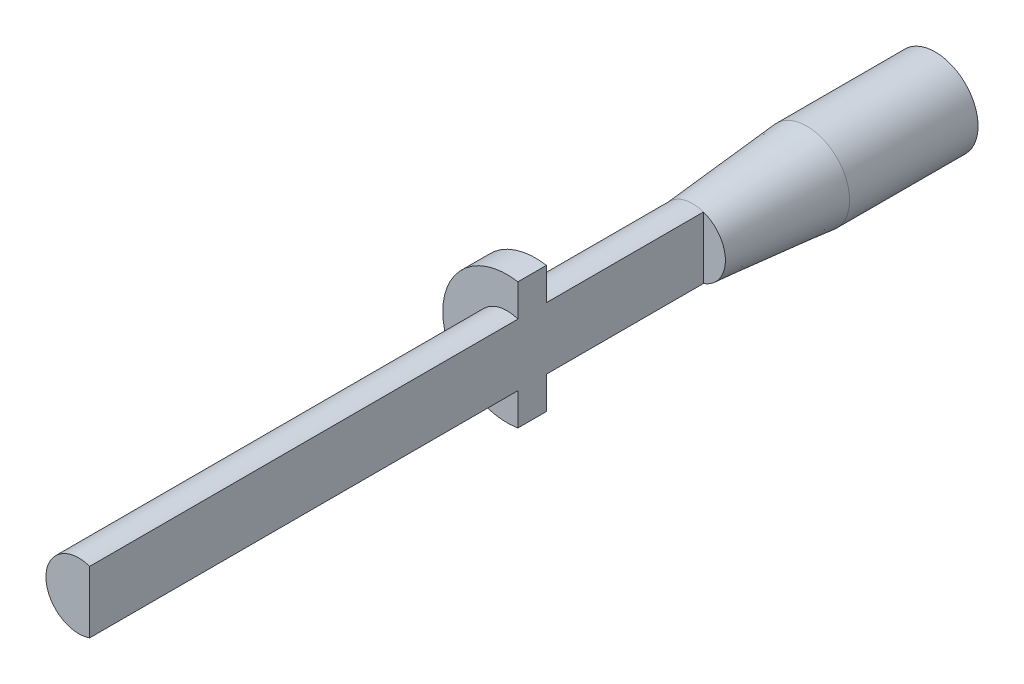
ISO-10303-21;
HEADER;
FILE_DESCRIPTION(('STEP AP214'),'2;1');
FILE_NAME('part.step','',(''),(''),'','','');
FILE_SCHEMA(('AUTOMOTIVE_DESIGN { 1 0 10303 214 1 1 1 1 }'));
ENDSEC;
DATA;
#1=APPLICATION_CONTEXT('core data for automotive mechanical design processes');
#2=APPLICATION_PROTOCOL_DEFINITION('international standard','automotive_design',2000,#1);
#3=PRODUCT_CONTEXT('',#1,'mechanical');
#4=PRODUCT('Part','Part','',(#3));
#5=PRODUCT_RELATED_PRODUCT_CATEGORY('part','',(#4));
#6=PRODUCT_DEFINITION_FORMATION('','',#4);
#7=PRODUCT_DEFINITION_CONTEXT('part definition',#1,'design');
#8=PRODUCT_DEFINITION('design','',#6,#7);
#9=PRODUCT_DEFINITION_SHAPE('','',#8);
#10=(LENGTH_UNIT() NAMED_UNIT(*) SI_UNIT(.MILLI.,.METRE.));
#11=(NAMED_UNIT(*) PLANE_ANGLE_UNIT() SI_UNIT($,.RADIAN.));
#12=(NAMED_UNIT(*) SI_UNIT($,.STERADIAN.) SOLID_ANGLE_UNIT());
#13=UNCERTAINTY_MEASURE_WITH_UNIT(LENGTH_MEASURE(1.E-05),#10,'distance_accuracy_value','');
#14=(GEOMETRIC_REPRESENTATION_CONTEXT(3) GLOBAL_UNCERTAINTY_ASSIGNED_CONTEXT((#13)) GLOBAL_UNIT_ASSIGNED_CONTEXT((#10,
#11,#12)) REPRESENTATION_CONTEXT('',''));
#15=CARTESIAN_POINT('',(0.,0.,0.));
#16=DIRECTION('',(0.,0.,1.));
#17=DIRECTION('',(1.,0.,0.));
#18=AXIS2_PLACEMENT_3D('',#15,#16,#17);
#19=CARTESIAN_POINT('',(0.,0.,-13.));
#20=DIRECTION('',(0.,0.,-1.));
#21=DIRECTION('',(-1.,0.,0.));
#22=AXIS2_PLACEMENT_3D('',#19,#20,#21);
#23=CYLINDRICAL_SURFACE('',#22,3.);
#24=CARTESIAN_POINT('',(0.,0.,-30.));
#25=DIRECTION('',(0.,0.,-1.));
#26=DIRECTION('',(-1.,0.,0.));
#27=AXIS2_PLACEMENT_3D('',#24,#25,#26);
#28=CIRCLE('',#27,3.);
#29=CARTESIAN_POINT('',(-3.,0.,-30.));
#30=VERTEX_POINT('',#29);
#31=EDGE_CURVE('E110',#30,#30,#28,.T.);
#32=ORIENTED_EDGE('',*,*,#31,.F.);
#33=EDGE_LOOP('',(#32));
#34=FACE_BOUND('',#33,.T.);
#35=CARTESIAN_POINT('',(0.,0.,-21.));
#36=DIRECTION('',(0.,0.,1.));
#37=DIRECTION('',(1.,0.,0.));
#38=AXIS2_PLACEMENT_3D('',#35,#36,#37);
#39=CIRCLE('',#38,3.);
#40=CARTESIAN_POINT('',(3.,0.,-21.));
#41=VERTEX_POINT('',#40);
#42=EDGE_CURVE('E168',#41,#41,#39,.T.);
#43=ORIENTED_EDGE('',*,*,#42,.F.);
#44=EDGE_LOOP('',(#43));
#45=FACE_BOUND('',#44,.T.);
#46=ADVANCED_FACE('F33',(#34,#45),#23,.T.);
#47=CARTESIAN_POINT('',(0.,0.,-30.));
#48=DIRECTION('',(0.,0.,1.));
#49=DIRECTION('',(1.,0.,0.));
#50=AXIS2_PLACEMENT_3D('',#47,#48,#49);
#51=PLANE('',#50);
#52=DIRECTION('',(0.,-1.,0.));
#53=VECTOR('',#52,1.);
#54=CARTESIAN_POINT('',(1.59,1.40979608454556,-30.));
#55=LINE('',#54,#53);
#56=CARTESIAN_POINT('',(1.59,1.40979608454556,-30.));
#57=VERTEX_POINT('',#56);
#58=CARTESIAN_POINT('',(1.59,-1.40979608454556,-30.));
#59=VERTEX_POINT('',#58);
#60=EDGE_CURVE('E163',#57,#59,#55,.T.);
#61=ORIENTED_EDGE('',*,*,#60,.F.);
#62=CARTESIAN_POINT('',(0.,0.,-30.));
#63=DIRECTION('',(0.,0.,-1.));
#64=DIRECTION('',(-1.,0.,0.));
#65=AXIS2_PLACEMENT_3D('',#62,#63,#64);
#66=CIRCLE('',#65,2.125);
#67=EDGE_CURVE('E48',#59,#57,#66,.T.);
#68=ORIENTED_EDGE('',*,*,#67,.F.);
#69=EDGE_LOOP('',(#61,#68));
#70=FACE_BOUND('',#69,.T.);
#71=ORIENTED_EDGE('',*,*,#31,.T.);
#72=EDGE_LOOP('',(#71));
#73=FACE_BOUND('',#72,.T.);
#74=ADVANCED_FACE('F178',(#70,#73),#51,.F.);
#75=CARTESIAN_POINT('',(0.,0.,-22.5));
#76=DIRECTION('',(0.,0.,-1.));
#77=DIRECTION('',(-1.,0.,0.));
#78=AXIS2_PLACEMENT_3D('',#75,#76,#77);
#79=CYLINDRICAL_SURFACE('',#78,2.125);
#80=ORIENTED_EDGE('',*,*,#67,.T.);
#81=DIRECTION('',(0.,0.,-1.));
#82=VECTOR('',#81,1.);
#83=CARTESIAN_POINT('',(1.59,1.40979608454556,-22.5));
#84=LINE('',#83,#82);
#85=CARTESIAN_POINT('',(1.59,1.40979608454556,-22.5));
#86=VERTEX_POINT('',#85);
#87=EDGE_CURVE('E159',#86,#57,#84,.T.);
#88=ORIENTED_EDGE('',*,*,#87,.F.);
#89=CARTESIAN_POINT('',(0.,0.,-22.5));
#90=DIRECTION('',(0.,0.,-1.));
#91=DIRECTION('',(-1.,0.,0.));
#92=AXIS2_PLACEMENT_3D('',#89,#90,#91);
#93=CIRCLE('',#92,2.125);
#94=CARTESIAN_POINT('',(1.59,-1.40979608454556,-22.5));
#95=VERTEX_POINT('',#94);
#96=EDGE_CURVE('E166',#95,#86,#93,.T.);
#97=ORIENTED_EDGE('',*,*,#96,.F.);
#98=DIRECTION('',(0.,0.,-1.));
#99=VECTOR('',#98,1.);
#100=CARTESIAN_POINT('',(1.59,-1.40979608454556,-22.5));
#101=LINE('',#100,#99);
#102=EDGE_CURVE('E158',#95,#59,#101,.T.);
#103=ORIENTED_EDGE('',*,*,#102,.T.);
#104=EDGE_LOOP('',(#80,#88,#97,#103));
#105=FACE_BOUND('',#104,.T.);
#106=ADVANCED_FACE('F184',(#105),#79,.F.);
#107=CARTESIAN_POINT('',(1.59,1.40979608454556,-22.5));
#108=DIRECTION('',(1.,0.,0.));
#109=DIRECTION('',(0.,0.,-1.));
#110=AXIS2_PLACEMENT_3D('',#107,#108,#109);
#111=PLANE('',#110);
#112=ORIENTED_EDGE('',*,*,#60,.T.);
#113=ORIENTED_EDGE('',*,*,#102,.F.);
#114=DIRECTION('',(0.,-1.,0.));
#115=VECTOR('',#114,1.);
#116=CARTESIAN_POINT('',(1.59,1.40979608454556,-22.5));
#117=LINE('',#116,#115);
#118=EDGE_CURVE('E161',#86,#95,#117,.T.);
#119=ORIENTED_EDGE('',*,*,#118,.F.);
#120=ORIENTED_EDGE('',*,*,#87,.T.);
#121=EDGE_LOOP('',(#112,#113,#119,#120));
#122=FACE_BOUND('',#121,.T.);
#123=ADVANCED_FACE('F245',(#122),#111,.F.);
#124=CARTESIAN_POINT('',(0.,0.,-22.5));
#125=DIRECTION('',(0.,0.,-1.));
#126=DIRECTION('',(-1.,0.,0.));
#127=AXIS2_PLACEMENT_3D('',#124,#125,#126);
#128=PLANE('',#127);
#129=ORIENTED_EDGE('',*,*,#96,.T.);
#130=ORIENTED_EDGE('',*,*,#118,.T.);
#131=EDGE_LOOP('',(#129,#130));
#132=FACE_BOUND('',#131,.T.);
#133=ADVANCED_FACE('F238',(#132),#128,.T.);
#134=CARTESIAN_POINT('',(0.,0.,-13.));
#135=DIRECTION('',(0.,0.,-1.));
#136=DIRECTION('',(-1.,0.,0.));
#137=AXIS2_PLACEMENT_3D('',#134,#135,#136);
#138=CONICAL_SURFACE('',#137,2.3,0.0872777129494616);
#139=ORIENTED_EDGE('',*,*,#42,.T.);
#140=EDGE_LOOP('',(#139));
#141=FACE_BOUND('',#140,.T.);
#142=CARTESIAN_POINT('',(0.,0.,-13.));
#143=DIRECTION('',(0.,0.,-1.));
#144=DIRECTION('',(-1.,0.,0.));
#145=AXIS2_PLACEMENT_3D('',#142,#143,#144);
#146=CIRCLE('',#145,2.3);
#147=CARTESIAN_POINT('',(0.762299153875957,2.17,-13.));
#148=VERTEX_POINT('',#147);
#149=CARTESIAN_POINT('',(0.762299153875957,-2.17,-13.));
#150=VERTEX_POINT('',#149);
#151=EDGE_CURVE('E41',#148,#150,#146,.F.);
#152=ORIENTED_EDGE('',*,*,#151,.F.);
#153=CARTESIAN_POINT('',(0.,0.,-13.));
#154=DIRECTION('',(0.,0.,-1.));
#155=DIRECTION('',(-1.,0.,0.));
#156=AXIS2_PLACEMENT_3D('',#153,#154,#155);
#157=CIRCLE('',#156,2.3);
#158=EDGE_CURVE('E11',#148,#150,#157,.T.);
#159=ORIENTED_EDGE('',*,*,#158,.T.);
#160=EDGE_LOOP('',(#152,#159));
#161=FACE_BOUND('',#160,.T.);
#162=ADVANCED_FACE('F94',(#141,#161),#138,.T.);
#163=CARTESIAN_POINT('',(0.,0.,30.));
#164=DIRECTION('',(0.,0.,1.));
#165=DIRECTION('',(1.,0.,0.));
#166=AXIS2_PLACEMENT_3D('',#163,#164,#165);
#167=PLANE('',#166);
#168=CARTESIAN_POINT('',(0.,0.,30.));
#169=DIRECTION('',(0.,0.,1.));
#170=DIRECTION('',(1.,0.,0.));
#171=AXIS2_PLACEMENT_3D('',#168,#169,#170);
#172=CIRCLE('',#171,2.3);
#173=CARTESIAN_POINT('',(0.762299153875957,2.17,30.));
#174=VERTEX_POINT('',#173);
#175=CARTESIAN_POINT('',(0.762299153875957,-2.17,30.));
#176=VERTEX_POINT('',#175);
#177=EDGE_CURVE('E109',#174,#176,#172,.T.);
#178=ORIENTED_EDGE('',*,*,#177,.T.);
#179=DIRECTION('',(0.,1.,0.));
#180=VECTOR('',#179,1.);
#181=CARTESIAN_POINT('',(0.762299153875957,-2.17,30.));
#182=LINE('',#181,#180);
#183=EDGE_CURVE('E122',#176,#174,#182,.T.);
#184=ORIENTED_EDGE('',*,*,#183,.T.);
#185=EDGE_LOOP('',(#178,#184));
#186=FACE_BOUND('',#185,.T.);
#187=ADVANCED_FACE('F191',(#186),#167,.T.);
#188=CARTESIAN_POINT('',(0.,0.,-30.));
#189=DIRECTION('',(0.,0.,1.));
#190=DIRECTION('',(1.,0.,0.));
#191=AXIS2_PLACEMENT_3D('',#188,#189,#190);
#192=CYLINDRICAL_SURFACE('',#191,2.3);
#193=DIRECTION('',(0.,0.,1.));
#194=VECTOR('',#193,1.);
#195=CARTESIAN_POINT('',(0.762299153875957,2.17,-30.));
#196=LINE('',#195,#194);
#197=CARTESIAN_POINT('',(0.762299153875957,2.17,0.));
#198=VERTEX_POINT('',#197);
#199=EDGE_CURVE('E116',#198,#174,#196,.T.);
#200=ORIENTED_EDGE('',*,*,#199,.F.);
#201=CARTESIAN_POINT('',(0.,0.,0.));
#202=DIRECTION('',(0.,0.,1.));
#203=DIRECTION('',(1.,0.,0.));
#204=AXIS2_PLACEMENT_3D('',#201,#202,#203);
#205=CIRCLE('',#204,2.3);
#206=CARTESIAN_POINT('',(0.762299153875957,-2.17,0.));
#207=VERTEX_POINT('',#206);
#208=EDGE_CURVE('E98',#198,#207,#205,.T.);
#209=ORIENTED_EDGE('',*,*,#208,.T.);
#210=DIRECTION('',(0.,0.,1.));
#211=VECTOR('',#210,1.);
#212=CARTESIAN_POINT('',(0.762299153875957,-2.17,-30.));
#213=LINE('',#212,#211);
#214=EDGE_CURVE('E124',#207,#176,#213,.T.);
#215=ORIENTED_EDGE('',*,*,#214,.T.);
#216=ORIENTED_EDGE('',*,*,#177,.F.);
#217=EDGE_LOOP('',(#200,#209,#215,#216));
#218=FACE_BOUND('',#217,.T.);
#219=ADVANCED_FACE('F147',(#218),#192,.T.);
#220=CARTESIAN_POINT('',(0.,0.,0.));
#221=DIRECTION('',(0.,0.,1.));
#222=DIRECTION('',(1.,0.,0.));
#223=AXIS2_PLACEMENT_3D('',#220,#221,#222);
#224=PLANE('',#223);
#225=ORIENTED_EDGE('',*,*,#208,.F.);
#226=DIRECTION('',(0.,1.,0.));
#227=VECTOR('',#226,1.);
#228=CARTESIAN_POINT('',(0.762299153875957,-4.43496335948788,0.));
#229=LINE('',#228,#227);
#230=CARTESIAN_POINT('',(0.762299153875957,4.43496335948788,0.));
#231=VERTEX_POINT('',#230);
#232=EDGE_CURVE('E136',#198,#231,#229,.T.);
#233=ORIENTED_EDGE('',*,*,#232,.T.);
#234=CARTESIAN_POINT('',(0.,0.,0.));
#235=DIRECTION('',(0.,0.,1.));
#236=DIRECTION('',(1.,0.,0.));
#237=AXIS2_PLACEMENT_3D('',#234,#235,#236);
#238=CIRCLE('',#237,4.5);
#239=CARTESIAN_POINT('',(0.762299153875957,-4.43496335948788,0.));
#240=VERTEX_POINT('',#239);
#241=EDGE_CURVE('E118',#231,#240,#238,.T.);
#242=ORIENTED_EDGE('',*,*,#241,.T.);
#243=EDGE_CURVE('E130',#240,#207,#229,.T.);
#244=ORIENTED_EDGE('',*,*,#243,.T.);
#245=EDGE_LOOP('',(#225,#233,#242,#244));
#246=FACE_BOUND('',#245,.T.);
#247=ADVANCED_FACE('F196',(#246),#224,.T.);
#248=CARTESIAN_POINT('',(0.,0.,-2.));
#249=DIRECTION('',(0.,0.,1.));
#250=DIRECTION('',(1.,0.,0.));
#251=AXIS2_PLACEMENT_3D('',#248,#249,#250);
#252=CYLINDRICAL_SURFACE('',#251,4.5);
#253=ORIENTED_EDGE('',*,*,#241,.F.);
#254=DIRECTION('',(0.,0.,1.));
#255=VECTOR('',#254,1.);
#256=CARTESIAN_POINT('',(0.762299153875957,4.43496335948788,-2.));
#257=LINE('',#256,#255);
#258=CARTESIAN_POINT('',(0.762299153875957,4.43496335948788,-2.));
#259=VERTEX_POINT('',#258);
#260=EDGE_CURVE('E138',#259,#231,#257,.T.);
#261=ORIENTED_EDGE('',*,*,#260,.F.);
#262=CARTESIAN_POINT('',(0.,0.,-2.));
#263=DIRECTION('',(0.,0.,1.));
#264=DIRECTION('',(1.,0.,0.));
#265=AXIS2_PLACEMENT_3D('',#262,#263,#264);
#266=CIRCLE('',#265,4.5);
#267=CARTESIAN_POINT('',(0.762299153875957,-4.43496335948788,-2.));
#268=VERTEX_POINT('',#267);
#269=EDGE_CURVE('E126',#259,#268,#266,.T.);
#270=ORIENTED_EDGE('',*,*,#269,.T.);
#271=DIRECTION('',(0.,0.,1.));
#272=VECTOR('',#271,1.);
#273=CARTESIAN_POINT('',(0.762299153875957,-4.43496335948788,-2.));
#274=LINE('',#273,#272);
#275=EDGE_CURVE('E133',#268,#240,#274,.T.);
#276=ORIENTED_EDGE('',*,*,#275,.T.);
#277=EDGE_LOOP('',(#253,#261,#270,#276));
#278=FACE_BOUND('',#277,.T.);
#279=ADVANCED_FACE('F35',(#278),#252,.T.);
#280=CARTESIAN_POINT('',(0.,0.,-2.));
#281=DIRECTION('',(0.,0.,1.));
#282=DIRECTION('',(1.,0.,0.));
#283=AXIS2_PLACEMENT_3D('',#280,#281,#282);
#284=PLANE('',#283);
#285=DIRECTION('',(0.,1.,0.));
#286=VECTOR('',#285,1.);
#287=CARTESIAN_POINT('',(0.762299153875957,-4.43496335948788,-2.));
#288=LINE('',#287,#286);
#289=CARTESIAN_POINT('',(0.762299153875957,2.17,-2.));
#290=VERTEX_POINT('',#289);
#291=EDGE_CURVE('E129',#290,#259,#288,.T.);
#292=ORIENTED_EDGE('',*,*,#291,.F.);
#293=CARTESIAN_POINT('',(0.,0.,-2.));
#294=DIRECTION('',(0.,0.,1.));
#295=DIRECTION('',(1.,0.,0.));
#296=AXIS2_PLACEMENT_3D('',#293,#294,#295);
#297=CIRCLE('',#296,2.3);
#298=CARTESIAN_POINT('',(0.762299153875957,-2.17,-2.));
#299=VERTEX_POINT('',#298);
#300=EDGE_CURVE('E114',#290,#299,#297,.T.);
#301=ORIENTED_EDGE('',*,*,#300,.T.);
#302=EDGE_CURVE('E131',#268,#299,#288,.T.);
#303=ORIENTED_EDGE('',*,*,#302,.F.);
#304=ORIENTED_EDGE('',*,*,#269,.F.);
#305=EDGE_LOOP('',(#292,#301,#303,#304));
#306=FACE_BOUND('',#305,.T.);
#307=ADVANCED_FACE('F197',(#306),#284,.F.);
#308=CARTESIAN_POINT('',(0.,0.,-13.));
#309=DIRECTION('',(0.,0.,-1.));
#310=DIRECTION('',(-1.,0.,0.));
#311=AXIS2_PLACEMENT_3D('',#308,#309,#310);
#312=PLANE('',#311);
#313=ORIENTED_EDGE('',*,*,#158,.F.);
#314=DIRECTION('',(0.,1.,0.));
#315=VECTOR('',#314,1.);
#316=CARTESIAN_POINT('',(0.762299153875957,-4.43496335948788,-13.));
#317=LINE('',#316,#315);
#318=EDGE_CURVE('E102',#150,#148,#317,.T.);
#319=ORIENTED_EDGE('',*,*,#318,.F.);
#320=EDGE_LOOP('',(#313,#319));
#321=FACE_BOUND('',#320,.T.);
#322=ADVANCED_FACE('F101',(#321),#312,.F.);
#323=CARTESIAN_POINT('',(0.762299153875957,-4.43496335948788,-2.));
#324=DIRECTION('',(1.,0.,0.));
#325=DIRECTION('',(0.,0.,-1.));
#326=AXIS2_PLACEMENT_3D('',#323,#324,#325);
#327=PLANE('',#326);
#328=EDGE_CURVE('E108',#150,#299,#213,.T.);
#329=ORIENTED_EDGE('',*,*,#328,.F.);
#330=ORIENTED_EDGE('',*,*,#318,.T.);
#331=EDGE_CURVE('E105',#148,#290,#196,.T.);
#332=ORIENTED_EDGE('',*,*,#331,.T.);
#333=ORIENTED_EDGE('',*,*,#291,.T.);
#334=ORIENTED_EDGE('',*,*,#260,.T.);
#335=ORIENTED_EDGE('',*,*,#232,.F.);
#336=ORIENTED_EDGE('',*,*,#199,.T.);
#337=ORIENTED_EDGE('',*,*,#183,.F.);
#338=ORIENTED_EDGE('',*,*,#214,.F.);
#339=ORIENTED_EDGE('',*,*,#243,.F.);
#340=ORIENTED_EDGE('',*,*,#275,.F.);
#341=ORIENTED_EDGE('',*,*,#302,.T.);
#342=EDGE_LOOP('',(#329,#330,#332,#333,#334,#335,#336,#337,#338,#339,#340,#341));
#343=FACE_BOUND('',#342,.T.);
#344=ADVANCED_FACE('F104',(#343),#327,.T.);
#345=ORIENTED_EDGE('',*,*,#331,.F.);
#346=ORIENTED_EDGE('',*,*,#151,.T.);
#347=ORIENTED_EDGE('',*,*,#328,.T.);
#348=ORIENTED_EDGE('',*,*,#300,.F.);
#349=EDGE_LOOP('',(#345,#346,#347,#348));
#350=FACE_BOUND('',#349,.T.);
#351=ADVANCED_FACE('F112',(#350),#192,.T.);
#352=CLOSED_SHELL('',(#46,#74,#106,#123,#133,#162,#187,#219,#247,#279,#307,#322,#344,#351));
#353=MANIFOLD_SOLID_BREP('B2',#352);
#354=ADVANCED_BREP_SHAPE_REPRESENTATION('',(#18,#353),#14);
#355=SHAPE_DEFINITION_REPRESENTATION(#9,#354);
ENDSEC;
END-ISO-10303-21;
